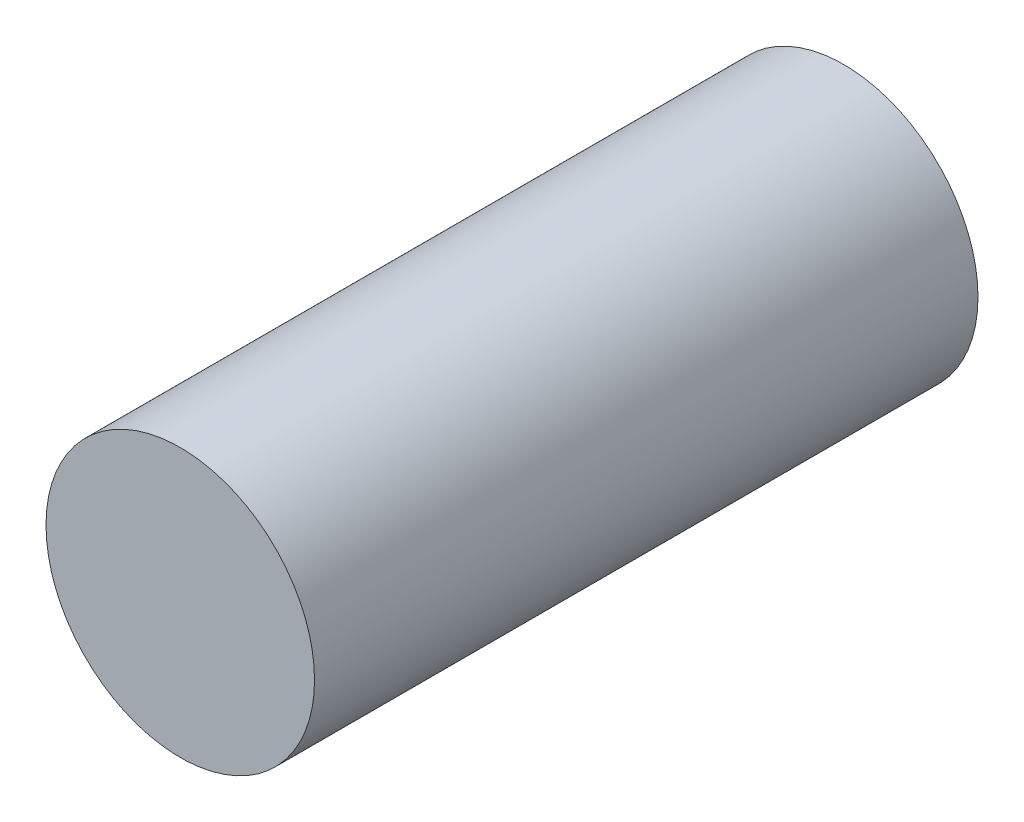
ISO-10303-21;
HEADER;
FILE_DESCRIPTION(('STEP AP214'),'2;1');
FILE_NAME('part.step','',(''),(''),'','','');
FILE_SCHEMA(('AUTOMOTIVE_DESIGN { 1 0 10303 214 1 1 1 1 }'));
ENDSEC;
DATA;
#1=APPLICATION_CONTEXT('core data for automotive mechanical design processes');
#2=APPLICATION_PROTOCOL_DEFINITION('international standard','automotive_design',2000,#1);
#3=PRODUCT_CONTEXT('',#1,'mechanical');
#4=PRODUCT('Part','Part','',(#3));
#5=PRODUCT_RELATED_PRODUCT_CATEGORY('part','',(#4));
#6=PRODUCT_DEFINITION_FORMATION('','',#4);
#7=PRODUCT_DEFINITION_CONTEXT('part definition',#1,'design');
#8=PRODUCT_DEFINITION('design','',#6,#7);
#9=PRODUCT_DEFINITION_SHAPE('','',#8);
#10=(LENGTH_UNIT() NAMED_UNIT(*) SI_UNIT(.MILLI.,.METRE.));
#11=(NAMED_UNIT(*) PLANE_ANGLE_UNIT() SI_UNIT($,.RADIAN.));
#12=(NAMED_UNIT(*) SI_UNIT($,.STERADIAN.) SOLID_ANGLE_UNIT());
#13=UNCERTAINTY_MEASURE_WITH_UNIT(LENGTH_MEASURE(1.E-05),#10,'distance_accuracy_value','');
#14=(GEOMETRIC_REPRESENTATION_CONTEXT(3) GLOBAL_UNCERTAINTY_ASSIGNED_CONTEXT((#13)) GLOBAL_UNIT_ASSIGNED_CONTEXT((#10,
#11,#12)) REPRESENTATION_CONTEXT('',''));
#15=CARTESIAN_POINT('',(0.,0.,0.));
#16=DIRECTION('',(0.,0.,1.));
#17=DIRECTION('',(1.,0.,0.));
#18=AXIS2_PLACEMENT_3D('',#15,#16,#17);
#19=CARTESIAN_POINT('',(0.,0.,42.));
#20=DIRECTION('',(0.,0.,-1.));
#21=DIRECTION('',(-1.,0.,0.));
#22=AXIS2_PLACEMENT_3D('',#19,#20,#21);
#23=CYLINDRICAL_SURFACE('',#22,8.5);
#24=CARTESIAN_POINT('',(0.,0.,42.));
#25=DIRECTION('',(0.,0.,1.));
#26=DIRECTION('',(1.,0.,0.));
#27=AXIS2_PLACEMENT_3D('',#24,#25,#26);
#28=CIRCLE('',#27,8.5);
#29=CARTESIAN_POINT('',(8.5,0.,42.));
#30=VERTEX_POINT('',#29);
#31=EDGE_CURVE('E10',#30,#30,#28,.T.);
#32=ORIENTED_EDGE('',*,*,#31,.F.);
#33=EDGE_LOOP('',(#32));
#34=FACE_BOUND('',#33,.T.);
#35=CARTESIAN_POINT('',(0.,0.,0.));
#36=DIRECTION('',(0.,0.,1.));
#37=DIRECTION('',(1.,0.,0.));
#38=AXIS2_PLACEMENT_3D('',#35,#36,#37);
#39=CIRCLE('',#38,8.5);
#40=CARTESIAN_POINT('',(8.5,0.,0.));
#41=VERTEX_POINT('',#40);
#42=EDGE_CURVE('E34',#41,#41,#39,.T.);
#43=ORIENTED_EDGE('',*,*,#42,.T.);
#44=EDGE_LOOP('',(#43));
#45=FACE_BOUND('',#44,.T.);
#46=ADVANCED_FACE('F31',(#34,#45),#23,.T.);
#47=CARTESIAN_POINT('',(0.,0.,42.));
#48=DIRECTION('',(0.,0.,1.));
#49=DIRECTION('',(1.,0.,0.));
#50=AXIS2_PLACEMENT_3D('',#47,#48,#49);
#51=PLANE('',#50);
#52=ORIENTED_EDGE('',*,*,#31,.T.);
#53=EDGE_LOOP('',(#52));
#54=FACE_BOUND('',#53,.T.);
#55=ADVANCED_FACE('F46',(#54),#51,.T.);
#56=CARTESIAN_POINT('',(0.,0.,0.));
#57=DIRECTION('',(0.,0.,1.));
#58=DIRECTION('',(1.,0.,0.));
#59=AXIS2_PLACEMENT_3D('',#56,#57,#58);
#60=PLANE('',#59);
#61=ORIENTED_EDGE('',*,*,#42,.F.);
#62=EDGE_LOOP('',(#61));
#63=FACE_BOUND('',#62,.T.);
#64=ADVANCED_FACE('F44',(#63),#60,.F.);
#65=CLOSED_SHELL('',(#46,#55,#64));
#66=MANIFOLD_SOLID_BREP('B2',#65);
#67=ADVANCED_BREP_SHAPE_REPRESENTATION('',(#18,#66),#14);
#68=SHAPE_DEFINITION_REPRESENTATION(#9,#67);
ENDSEC;
END-ISO-10303-21;
